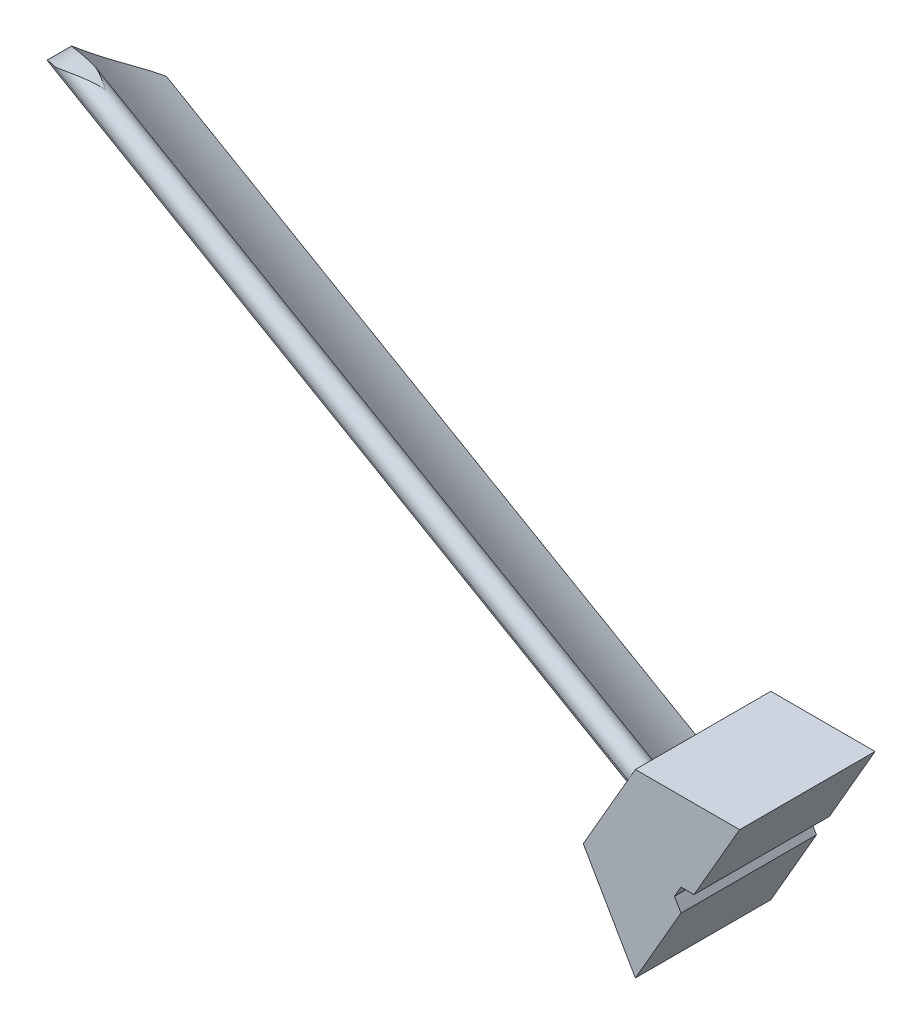
ISO-10303-21;
HEADER;
FILE_DESCRIPTION(('STEP AP214'),'2;1');
FILE_NAME('part.step','',(''),(''),'','','');
FILE_SCHEMA(('AUTOMOTIVE_DESIGN { 1 0 10303 214 1 1 1 1 }'));
ENDSEC;
DATA;
#1=APPLICATION_CONTEXT('core data for automotive mechanical design processes');
#2=APPLICATION_PROTOCOL_DEFINITION('international standard','automotive_design',2000,#1);
#3=PRODUCT_CONTEXT('',#1,'mechanical');
#4=PRODUCT('Part','Part','',(#3));
#5=PRODUCT_RELATED_PRODUCT_CATEGORY('part','',(#4));
#6=PRODUCT_DEFINITION_FORMATION('','',#4);
#7=PRODUCT_DEFINITION_CONTEXT('part definition',#1,'design');
#8=PRODUCT_DEFINITION('design','',#6,#7);
#9=PRODUCT_DEFINITION_SHAPE('','',#8);
#10=(LENGTH_UNIT() NAMED_UNIT(*) SI_UNIT(.MILLI.,.METRE.));
#11=(NAMED_UNIT(*) PLANE_ANGLE_UNIT() SI_UNIT($,.RADIAN.));
#12=(NAMED_UNIT(*) SI_UNIT($,.STERADIAN.) SOLID_ANGLE_UNIT());
#13=UNCERTAINTY_MEASURE_WITH_UNIT(LENGTH_MEASURE(1.E-05),#10,'distance_accuracy_value','');
#14=(GEOMETRIC_REPRESENTATION_CONTEXT(3) GLOBAL_UNCERTAINTY_ASSIGNED_CONTEXT((#13)) GLOBAL_UNIT_ASSIGNED_CONTEXT((#10,
#11,#12)) REPRESENTATION_CONTEXT('',''));
#15=CARTESIAN_POINT('',(0.,0.,0.));
#16=DIRECTION('',(0.,0.,1.));
#17=DIRECTION('',(1.,0.,0.));
#18=AXIS2_PLACEMENT_3D('',#15,#16,#17);
#19=CARTESIAN_POINT('',(-9.23760430703402,16.,24.));
#20=DIRECTION('',(0.866025403784439,-0.5,0.));
#21=DIRECTION('',(0.5,0.866025403784439,0.));
#22=AXIS2_PLACEMENT_3D('',#19,#20,#21);
#23=PLANE('',#22);
#24=CARTESIAN_POINT('',(-4.02817982507704,25.0229878809427,-1.9959936670744));
#25=DIRECTION('',(-0.866025403784439,0.5,0.));
#26=DIRECTION('',(0.5,0.866025403784439,0.));
#27=AXIS2_PLACEMENT_3D('',#24,#25,#26);
#28=CIRCLE('',#27,28.9199879292272);
#29=CARTESIAN_POINT('',(-18.4512267717139,0.0415377694163993,0.0700578635219086));
#30=VERTEX_POINT('',#29);
#31=CARTESIAN_POINT('',(-10.9585334040135,13.0192633678079,23.3860176580814));
#32=VERTEX_POINT('',#31);
#33=EDGE_CURVE('E280',#30,#32,#28,.T.);
#34=ORIENTED_EDGE('',*,*,#33,.F.);
#35=CARTESIAN_POINT('',(-18.375208614068,0.173205080756883,0.2));
#36=DIRECTION('',(-0.866025403784439,0.5,0.));
#37=DIRECTION('',(-0.5,-0.866025403784439,0.));
#38=AXIS2_PLACEMENT_3D('',#35,#36,#37);
#39=CIRCLE('',#38,0.2);
#40=CARTESIAN_POINT('',(-18.375208614068,0.173205080756883,0.));
#41=VERTEX_POINT('',#40);
#42=EDGE_CURVE('E209',#41,#30,#39,.T.);
#43=ORIENTED_EDGE('',*,*,#42,.F.);
#44=DIRECTION('',(-0.5,-0.866025403784439,0.));
#45=VECTOR('',#44,1.);
#46=CARTESIAN_POINT('',(-9.23760430703402,16.,0.));
#47=LINE('',#46,#45);
#48=CARTESIAN_POINT('',(-18.475208614068,0.,0.));
#49=VERTEX_POINT('',#48);
#50=EDGE_CURVE('E199',#41,#49,#47,.T.);
#51=ORIENTED_EDGE('',*,*,#50,.T.);
#52=DIRECTION('',(0.,0.,-1.));
#53=VECTOR('',#52,1.);
#54=CARTESIAN_POINT('',(-18.475208614068,0.,24.));
#55=LINE('',#54,#53);
#56=CARTESIAN_POINT('',(-18.475208614068,0.,24.));
#57=VERTEX_POINT('',#56);
#58=EDGE_CURVE('E203',#57,#49,#55,.T.);
#59=ORIENTED_EDGE('',*,*,#58,.F.);
#60=DIRECTION('',(-0.5,-0.866025403784439,0.));
#61=VECTOR('',#60,1.);
#62=CARTESIAN_POINT('',(-9.23760430703402,16.,24.));
#63=LINE('',#62,#61);
#64=CARTESIAN_POINT('',(-10.237604307034,14.2679491924312,24.));
#65=VERTEX_POINT('',#64);
#66=EDGE_CURVE('E181',#65,#57,#63,.T.);
#67=ORIENTED_EDGE('',*,*,#66,.F.);
#68=CARTESIAN_POINT('',(-10.237604307034,14.2679491924312,22.0000000000001));
#69=DIRECTION('',(-0.866025403784439,0.5,0.));
#70=DIRECTION('',(-0.5,-0.866025403784439,0.));
#71=AXIS2_PLACEMENT_3D('',#68,#69,#70);
#72=CIRCLE('',#71,2.);
#73=EDGE_CURVE('E254',#32,#65,#72,.T.);
#74=ORIENTED_EDGE('',*,*,#73,.F.);
#75=EDGE_LOOP('',(#34,#43,#51,#59,#67,#74));
#76=FACE_BOUND('',#75,.T.);
#77=ADVANCED_FACE('F33',(#76),#23,.F.);
#78=CARTESIAN_POINT('',(-9.23760430703402,16.,22.0000000000001));
#79=VERTEX_POINT('',#78);
#80=EDGE_CURVE('E274',#65,#79,#72,.T.);
#81=ORIENTED_EDGE('',*,*,#80,.F.);
#82=CARTESIAN_POINT('',(-9.23760430703402,16.,24.));
#83=VERTEX_POINT('',#82);
#84=EDGE_CURVE('E184',#83,#65,#63,.T.);
#85=ORIENTED_EDGE('',*,*,#84,.F.);
#86=DIRECTION('',(0.,0.,-1.));
#87=VECTOR('',#86,1.);
#88=CARTESIAN_POINT('',(-9.23760430703402,16.,24.));
#89=LINE('',#88,#87);
#90=EDGE_CURVE('E165',#83,#79,#89,.T.);
#91=ORIENTED_EDGE('',*,*,#90,.T.);
#92=EDGE_LOOP('',(#81,#85,#91));
#93=FACE_BOUND('',#92,.T.);
#94=ADVANCED_FACE('F332',(#93),#23,.F.);
#95=CARTESIAN_POINT('',(-9.54017674296634,15.4759291679953,20.5666894364743));
#96=VERTEX_POINT('',#95);
#97=EDGE_CURVE('E164',#79,#96,#72,.T.);
#98=ORIENTED_EDGE('',*,*,#97,.F.);
#99=CARTESIAN_POINT('',(-9.23760430703402,16.,0.));
#100=VERTEX_POINT('',#99);
#101=EDGE_CURVE('E206',#79,#100,#89,.T.);
#102=ORIENTED_EDGE('',*,*,#101,.T.);
#103=EDGE_CURVE('E187',#100,#41,#47,.T.);
#104=ORIENTED_EDGE('',*,*,#103,.T.);
#105=CARTESIAN_POINT('',(-18.2991904564221,0.304872392097363,0.0700578635219069));
#106=VERTEX_POINT('',#105);
#107=EDGE_CURVE('E277',#106,#41,#39,.T.);
#108=ORIENTED_EDGE('',*,*,#107,.F.);
#109=CARTESIAN_POINT('',(-3.07077257050956,26.6812658893886,-8.22628528919811));
#110=DIRECTION('',(0.866025403784439,-0.5,0.));
#111=DIRECTION('',(0.5,0.866025403784439,0.));
#112=AXIS2_PLACEMENT_3D('',#109,#110,#111);
#113=CIRCLE('',#112,31.5665670439408);
#114=EDGE_CURVE('E273',#96,#106,#113,.T.);
#115=ORIENTED_EDGE('',*,*,#114,.F.);
#116=EDGE_LOOP('',(#98,#102,#104,#108,#115));
#117=FACE_BOUND('',#116,.T.);
#118=ADVANCED_FACE('F334',(#117),#23,.F.);
#119=CARTESIAN_POINT('',(0.,0.,24.));
#120=DIRECTION('',(0.,0.,1.));
#121=DIRECTION('',(1.,0.,0.));
#122=AXIS2_PLACEMENT_3D('',#119,#120,#121);
#123=PLANE('',#122);
#124=DIRECTION('',(-0.5,-0.866025403784439,0.));
#125=VECTOR('',#124,1.);
#126=CARTESIAN_POINT('',(9.23760430703401,16.,24.));
#127=LINE('',#126,#125);
#128=CARTESIAN_POINT('',(9.23760430703401,16.,24.));
#129=VERTEX_POINT('',#128);
#130=CARTESIAN_POINT('',(1.15470053837925,2.00000000000002,24.));
#131=VERTEX_POINT('',#130);
#132=EDGE_CURVE('E156',#129,#131,#127,.T.);
#133=ORIENTED_EDGE('',*,*,#132,.F.);
#134=DIRECTION('',(-1.,0.,0.));
#135=VECTOR('',#134,1.);
#136=CARTESIAN_POINT('',(9.23760430703401,16.,24.));
#137=LINE('',#136,#135);
#138=EDGE_CURVE('E171',#129,#83,#137,.T.);
#139=ORIENTED_EDGE('',*,*,#138,.T.);
#140=ORIENTED_EDGE('',*,*,#84,.T.);
#141=ORIENTED_EDGE('',*,*,#66,.T.);
#142=DIRECTION('',(0.5,-0.866025403784438,0.));
#143=VECTOR('',#142,1.);
#144=CARTESIAN_POINT('',(-18.475208614068,0.,24.));
#145=LINE('',#144,#143);
#146=CARTESIAN_POINT('',(-9.23760430703401,-16.,24.));
#147=VERTEX_POINT('',#146);
#148=EDGE_CURVE('E193',#57,#147,#145,.T.);
#149=ORIENTED_EDGE('',*,*,#148,.T.);
#150=CARTESIAN_POINT('',(-1.15470053837926,-2.00000000000002,24.));
#151=VERTEX_POINT('',#150);
#152=EDGE_CURVE('E176',#151,#147,#127,.T.);
#153=ORIENTED_EDGE('',*,*,#152,.F.);
#154=DIRECTION('',(0.500000000000006,-0.866025403784435,0.));
#155=VECTOR('',#154,1.);
#156=CARTESIAN_POINT('',(-2.30940107675853,0.,24.));
#157=LINE('',#156,#155);
#158=CARTESIAN_POINT('',(-2.30940107675853,0.,24.));
#159=VERTEX_POINT('',#158);
#160=EDGE_CURVE('E294',#159,#151,#157,.T.);
#161=ORIENTED_EDGE('',*,*,#160,.F.);
#162=DIRECTION('',(-0.500000000000001,-0.866025403784438,0.));
#163=VECTOR('',#162,1.);
#164=CARTESIAN_POINT('',(-1.15470053837926,2.00000000000002,24.));
#165=LINE('',#164,#163);
#166=CARTESIAN_POINT('',(-1.15470053837926,2.00000000000002,24.));
#167=VERTEX_POINT('',#166);
#168=EDGE_CURVE('E291',#167,#159,#165,.T.);
#169=ORIENTED_EDGE('',*,*,#168,.F.);
#170=DIRECTION('',(-1.,0.,0.));
#171=VECTOR('',#170,1.);
#172=CARTESIAN_POINT('',(1.15470053837925,2.00000000000002,24.));
#173=LINE('',#172,#171);
#174=EDGE_CURVE('E174',#131,#167,#173,.T.);
#175=ORIENTED_EDGE('',*,*,#174,.F.);
#176=EDGE_LOOP('',(#133,#139,#140,#141,#149,#153,#161,#169,#175));
#177=FACE_BOUND('',#176,.T.);
#178=ADVANCED_FACE('F169',(#177),#123,.T.);
#179=CARTESIAN_POINT('',(0.,0.,0.));
#180=DIRECTION('',(0.,0.,1.));
#181=DIRECTION('',(1.,0.,0.));
#182=AXIS2_PLACEMENT_3D('',#179,#180,#181);
#183=PLANE('',#182);
#184=DIRECTION('',(-1.,0.,0.));
#185=VECTOR('',#184,1.);
#186=CARTESIAN_POINT('',(9.23760430703401,16.,0.));
#187=LINE('',#186,#185);
#188=CARTESIAN_POINT('',(9.23760430703401,16.,0.));
#189=VERTEX_POINT('',#188);
#190=EDGE_CURVE('E197',#189,#100,#187,.T.);
#191=ORIENTED_EDGE('',*,*,#190,.F.);
#192=DIRECTION('',(-0.5,-0.866025403784439,0.));
#193=VECTOR('',#192,1.);
#194=CARTESIAN_POINT('',(0.,0.,0.));
#195=LINE('',#194,#193);
#196=CARTESIAN_POINT('',(1.15470053837926,2.00000000000002,0.));
#197=VERTEX_POINT('',#196);
#198=EDGE_CURVE('E159',#189,#197,#195,.T.);
#199=ORIENTED_EDGE('',*,*,#198,.T.);
#200=DIRECTION('',(-1.,0.,0.));
#201=VECTOR('',#200,1.);
#202=CARTESIAN_POINT('',(1.15470053837925,2.00000000000002,0.));
#203=LINE('',#202,#201);
#204=CARTESIAN_POINT('',(-1.15470053837926,2.00000000000002,0.));
#205=VERTEX_POINT('',#204);
#206=EDGE_CURVE('E289',#197,#205,#203,.T.);
#207=ORIENTED_EDGE('',*,*,#206,.T.);
#208=DIRECTION('',(-0.500000000000001,-0.866025403784438,0.));
#209=VECTOR('',#208,1.);
#210=CARTESIAN_POINT('',(-1.15470053837926,2.00000000000002,0.));
#211=LINE('',#210,#209);
#212=CARTESIAN_POINT('',(-2.30940107675853,0.,0.));
#213=VERTEX_POINT('',#212);
#214=EDGE_CURVE('E300',#205,#213,#211,.T.);
#215=ORIENTED_EDGE('',*,*,#214,.T.);
#216=DIRECTION('',(0.500000000000006,-0.866025403784435,0.));
#217=VECTOR('',#216,1.);
#218=CARTESIAN_POINT('',(-2.30940107675853,0.,0.));
#219=LINE('',#218,#217);
#220=CARTESIAN_POINT('',(-1.15470053837926,-2.00000000000002,0.));
#221=VERTEX_POINT('',#220);
#222=EDGE_CURVE('E292',#213,#221,#219,.T.);
#223=ORIENTED_EDGE('',*,*,#222,.T.);
#224=CARTESIAN_POINT('',(-9.23760430703401,-16.,0.));
#225=VERTEX_POINT('',#224);
#226=EDGE_CURVE('E175',#221,#225,#195,.T.);
#227=ORIENTED_EDGE('',*,*,#226,.T.);
#228=DIRECTION('',(0.5,-0.866025403784438,0.));
#229=VECTOR('',#228,1.);
#230=CARTESIAN_POINT('',(-18.475208614068,0.,0.));
#231=LINE('',#230,#229);
#232=EDGE_CURVE('E182',#49,#225,#231,.T.);
#233=ORIENTED_EDGE('',*,*,#232,.F.);
#234=ORIENTED_EDGE('',*,*,#50,.F.);
#235=ORIENTED_EDGE('',*,*,#103,.F.);
#236=EDGE_LOOP('',(#191,#199,#207,#215,#223,#227,#233,#234,#235));
#237=FACE_BOUND('',#236,.T.);
#238=ADVANCED_FACE('F314',(#237),#183,.F.);
#239=CARTESIAN_POINT('',(9.23760430703401,16.,24.));
#240=DIRECTION('',(0.,-1.,0.));
#241=DIRECTION('',(0.,0.,-1.));
#242=AXIS2_PLACEMENT_3D('',#239,#240,#241);
#243=PLANE('',#242);
#244=ORIENTED_EDGE('',*,*,#190,.T.);
#245=ORIENTED_EDGE('',*,*,#101,.F.);
#246=ORIENTED_EDGE('',*,*,#90,.F.);
#247=ORIENTED_EDGE('',*,*,#138,.F.);
#248=DIRECTION('',(0.,0.,-1.));
#249=VECTOR('',#248,1.);
#250=CARTESIAN_POINT('',(9.23760430703401,16.,24.));
#251=LINE('',#250,#249);
#252=EDGE_CURVE('E153',#129,#189,#251,.T.);
#253=ORIENTED_EDGE('',*,*,#252,.T.);
#254=EDGE_LOOP('',(#244,#245,#246,#247,#253));
#255=FACE_BOUND('',#254,.T.);
#256=ADVANCED_FACE('F35',(#255),#243,.F.);
#257=CARTESIAN_POINT('',(-18.475208614068,0.,24.));
#258=DIRECTION('',(0.866025403784439,0.5,0.));
#259=DIRECTION('',(-0.5,0.866025403784439,0.));
#260=AXIS2_PLACEMENT_3D('',#257,#258,#259);
#261=PLANE('',#260);
#262=ORIENTED_EDGE('',*,*,#232,.T.);
#263=DIRECTION('',(0.,0.,-1.));
#264=VECTOR('',#263,1.);
#265=CARTESIAN_POINT('',(-9.23760430703401,-16.,24.));
#266=LINE('',#265,#264);
#267=EDGE_CURVE('E196',#147,#225,#266,.T.);
#268=ORIENTED_EDGE('',*,*,#267,.F.);
#269=ORIENTED_EDGE('',*,*,#148,.F.);
#270=ORIENTED_EDGE('',*,*,#58,.T.);
#271=EDGE_LOOP('',(#262,#268,#269,#270));
#272=FACE_BOUND('',#271,.T.);
#273=ADVANCED_FACE('F321',(#272),#261,.F.);
#274=CARTESIAN_POINT('',(1.15470053837925,2.00000000000002,24.));
#275=DIRECTION('',(0.,-1.,0.));
#276=DIRECTION('',(0.,0.,-1.));
#277=AXIS2_PLACEMENT_3D('',#274,#275,#276);
#278=PLANE('',#277);
#279=ORIENTED_EDGE('',*,*,#206,.F.);
#280=DIRECTION('',(0.,0.,-1.));
#281=VECTOR('',#280,1.);
#282=CARTESIAN_POINT('',(1.15470053837925,2.00000000000002,24.));
#283=LINE('',#282,#281);
#284=EDGE_CURVE('E190',#131,#197,#283,.T.);
#285=ORIENTED_EDGE('',*,*,#284,.F.);
#286=ORIENTED_EDGE('',*,*,#174,.T.);
#287=DIRECTION('',(0.,0.,-1.));
#288=VECTOR('',#287,1.);
#289=CARTESIAN_POINT('',(-1.15470053837926,2.00000000000002,24.));
#290=LINE('',#289,#288);
#291=EDGE_CURVE('E308',#167,#205,#290,.T.);
#292=ORIENTED_EDGE('',*,*,#291,.T.);
#293=EDGE_LOOP('',(#279,#285,#286,#292));
#294=FACE_BOUND('',#293,.T.);
#295=ADVANCED_FACE('F318',(#294),#278,.T.);
#296=CARTESIAN_POINT('',(-1.15470053837926,2.00000000000002,24.));
#297=DIRECTION('',(0.866025403784438,-0.500000000000001,0.));
#298=DIRECTION('',(0.500000000000001,0.866025403784438,0.));
#299=AXIS2_PLACEMENT_3D('',#296,#297,#298);
#300=PLANE('',#299);
#301=ORIENTED_EDGE('',*,*,#214,.F.);
#302=ORIENTED_EDGE('',*,*,#291,.F.);
#303=ORIENTED_EDGE('',*,*,#168,.T.);
#304=DIRECTION('',(0.,0.,-1.));
#305=VECTOR('',#304,1.);
#306=CARTESIAN_POINT('',(-2.30940107675853,0.,24.));
#307=LINE('',#306,#305);
#308=EDGE_CURVE('E307',#159,#213,#307,.T.);
#309=ORIENTED_EDGE('',*,*,#308,.T.);
#310=EDGE_LOOP('',(#301,#302,#303,#309));
#311=FACE_BOUND('',#310,.T.);
#312=ADVANCED_FACE('F320',(#311),#300,.T.);
#313=CARTESIAN_POINT('',(-2.30940107675853,0.,24.));
#314=DIRECTION('',(0.866025403784435,0.500000000000006,0.));
#315=DIRECTION('',(-0.500000000000006,0.866025403784435,0.));
#316=AXIS2_PLACEMENT_3D('',#313,#314,#315);
#317=PLANE('',#316);
#318=ORIENTED_EDGE('',*,*,#222,.F.);
#319=ORIENTED_EDGE('',*,*,#308,.F.);
#320=ORIENTED_EDGE('',*,*,#160,.T.);
#321=DIRECTION('',(0.,0.,-1.));
#322=VECTOR('',#321,1.);
#323=CARTESIAN_POINT('',(-1.15470053837926,-2.00000000000002,24.));
#324=LINE('',#323,#322);
#325=EDGE_CURVE('E297',#151,#221,#324,.T.);
#326=ORIENTED_EDGE('',*,*,#325,.T.);
#327=EDGE_LOOP('',(#318,#319,#320,#326));
#328=FACE_BOUND('',#327,.T.);
#329=ADVANCED_FACE('F231',(#328),#317,.T.);
#330=CARTESIAN_POINT('',(-114.160652761167,74.2679491924312,22.0000000000001));
#331=DIRECTION('',(0.866025403784439,-0.5,0.));
#332=DIRECTION('',(0.5,0.866025403784439,0.));
#333=AXIS2_PLACEMENT_3D('',#330,#331,#332);
#334=CYLINDRICAL_SURFACE('',#333,2.);
#335=DIRECTION('',(0.866025403784439,-0.5,0.));
#336=VECTOR('',#335,1.);
#337=CARTESIAN_POINT('',(-113.463225197099,75.4759291679953,20.5666894364743));
#338=LINE('',#337,#336);
#339=CARTESIAN_POINT('',(-108.328060596806,72.5111405036834,20.5666894364742));
#340=VERTEX_POINT('',#339);
#341=EDGE_CURVE('E287',#340,#96,#338,.T.);
#342=ORIENTED_EDGE('',*,*,#341,.F.);
#343=CARTESIAN_POINT('',(-108.328060596806,72.5111405036834,20.5666894364742));
#344=CARTESIAN_POINT('',(-108.185750200659,72.4882949807864,20.6167004446375));
#345=CARTESIAN_POINT('',(-108.044692144843,72.4622321820191,20.6687304028651));
#346=CARTESIAN_POINT('',(-107.765212976878,72.4038752900972,20.7761619795796));
#347=CARTESIAN_POINT('',(-107.626791184924,72.371582827939,20.8315627129659));
#348=CARTESIAN_POINT('',(-107.352676109039,72.3009664272526,20.9450824289283));
#349=CARTESIAN_POINT('',(-107.216982160389,72.262643978702,21.0032007375192));
#350=CARTESIAN_POINT('',(-106.948362076143,72.1801264087187,21.1216189511067));
#351=CARTESIAN_POINT('',(-106.815436108368,72.1359309323998,21.1819189877772));
#352=CARTESIAN_POINT('',(-106.424624017879,71.9960810167973,21.3636060918149));
#353=CARTESIAN_POINT('',(-106.170790747821,71.8921450037323,21.487429615361));
#354=CARTESIAN_POINT('',(-105.674768620484,71.6628872716582,21.7381415162455));
#355=CARTESIAN_POINT('',(-105.432572880823,71.5375783970454,21.8650280137467));
#356=CARTESIAN_POINT('',(-105.19147112489,71.3989845076477,21.9945950188014));
#357=CARTESIAN_POINT('',(-105.186444994281,71.3960889945059,21.9972975220793));
#358=CARTESIAN_POINT('',(-105.181421645875,71.3931887676601,22.0000000000001));
#359=B_SPLINE_CURVE_WITH_KNOTS('',3,(#343,#344,#345,#346,#347,#348,#349,#350,#351,#352,#353,
#354,#355,#356,#357,#358),.UNSPECIFIED.,.F.,.F.,(4,2,2,2,2,2,2,4),(0.,0.457598475343755,
0.915077308411905,1.37244327789457,1.82983689695642,2.73156949959285,3.63276208739183,
3.65195961766604),.UNSPECIFIED.);
#360=CARTESIAN_POINT('',(-105.181421645875,71.3931887676601,22.0000000000001));
#361=VERTEX_POINT('',#360);
#362=EDGE_CURVE('E239',#340,#361,#359,.T.);
#363=ORIENTED_EDGE('',*,*,#362,.T.);
#364=CARTESIAN_POINT('',(-105.114365337323,71.3540962614766,21.9638380059937));
#365=CARTESIAN_POINT('',(-105.131663942905,71.3642788761109,21.9731891957275));
#366=CARTESIAN_POINT('',(-105.148995394022,71.3744047118362,21.9825406955754));
#367=CARTESIAN_POINT('',(-105.171377599523,71.3873835098483,21.9945949777944));
#368=CARTESIAN_POINT('',(-105.176398251257,71.3902885095174,21.9972974759486));
#369=CARTESIAN_POINT('',(-105.181421645875,71.3931887676601,22.0000000000001));
#370=B_SPLINE_CURVE_WITH_KNOTS('',3,(#364,#365,#366,#367,#368,#369),.UNSPECIFIED.,.F.,.F.,(4,2,
4),(0.,0.0664323766493922,0.0856299069235968),.UNSPECIFIED.);
#371=CARTESIAN_POINT('',(-105.114365337323,71.3540962614766,21.9638380059935));
#372=VERTEX_POINT('',#371);
#373=EDGE_CURVE('E255',#361,#372,#370,.F.);
#374=ORIENTED_EDGE('',*,*,#373,.T.);
#375=CARTESIAN_POINT('',(-106.114201862735,69.6223286002004,22.0000000000001));
#376=DIRECTION('',(0.866025403784439,-0.5,0.));
#377=DIRECTION('',(0.499918262705857,0.865883830638108,-0.0180809970033081));
#378=AXIS2_PLACEMENT_3D('',#375,#376,#377);
#379=CIRCLE('',#378,2.00000000000001);
#380=CARTESIAN_POINT('',(-105.114365337323,71.3540962614766,22.0361619940066));
#381=VERTEX_POINT('',#380);
#382=EDGE_CURVE('E11',#372,#381,#379,.T.);
#383=ORIENTED_EDGE('',*,*,#382,.T.);
#384=CARTESIAN_POINT('',(-105.114365337323,71.3540962614766,22.0361619940065));
#385=CARTESIAN_POINT('',(-105.131663942905,71.3642788761109,22.0268108042729));
#386=CARTESIAN_POINT('',(-105.148995394022,71.3744047118362,22.017459304425));
#387=CARTESIAN_POINT('',(-105.171377599523,71.3873835098483,22.0054050222058));
#388=CARTESIAN_POINT('',(-105.176398251257,71.3902885095175,22.0027025240515));
#389=CARTESIAN_POINT('',(-105.181421645875,71.3931887676601,22.0000000000001));
#390=B_SPLINE_CURVE_WITH_KNOTS('',3,(#384,#385,#386,#387,#388,#389),.UNSPECIFIED.,.F.,.F.,(4,2,
4),(0.,0.0664323766494272,0.0856299069236231),.UNSPECIFIED.);
#391=EDGE_CURVE('E252',#381,#361,#390,.T.);
#392=ORIENTED_EDGE('',*,*,#391,.T.);
#393=CARTESIAN_POINT('',(-113.121931282864,72.0033286344889,23.3860176580814));
#394=CARTESIAN_POINT('',(-113.069873413456,72.0235423176739,23.4313113297646));
#395=CARTESIAN_POINT('',(-113.015555743239,72.0440710331597,23.4737845756024));
#396=CARTESIAN_POINT('',(-112.903169722411,72.0852632199291,23.5531386600222));
#397=CARTESIAN_POINT('',(-112.845108000312,72.1059263978319,23.5900290149174));
#398=CARTESIAN_POINT('',(-112.726448950097,72.1467482300241,23.6580597567401));
#399=CARTESIAN_POINT('',(-112.665884901944,72.1669099083865,23.6892567882534));
#400=CARTESIAN_POINT('',(-112.542194701369,72.2066111473305,23.7466185136256));
#401=CARTESIAN_POINT('',(-112.479067158394,72.2261503597217,23.7727804308375));
#402=CARTESIAN_POINT('',(-112.330799522109,72.2702481119349,23.8277283455301));
#403=CARTESIAN_POINT('',(-112.244922487377,72.2944764863497,23.85479749239));
#404=CARTESIAN_POINT('',(-112.070588317804,72.3408756851385,23.901419944647));
#405=CARTESIAN_POINT('',(-111.982129279595,72.3630449385393,23.9209675467582));
#406=CARTESIAN_POINT('',(-111.713310017072,72.426101214621,23.9695269576185));
#407=CARTESIAN_POINT('',(-111.530163270256,72.4633394362974,23.9882275257593));
#408=CARTESIAN_POINT('',(-111.207239079791,72.5187461113742,24.0016641166158));
#409=CARTESIAN_POINT('',(-111.067985984735,72.5393537614493,24.0011980299659));
#410=CARTESIAN_POINT('',(-110.789036113971,72.5741410644579,23.9897968551192));
#411=CARTESIAN_POINT('',(-110.649339155792,72.5883175941234,23.9788566881993));
#412=CARTESIAN_POINT('',(-110.370376972542,72.6102368966745,23.9481693018106));
#413=CARTESIAN_POINT('',(-110.231112011512,72.6179763004458,23.928417478725));
#414=CARTESIAN_POINT('',(-109.953608735515,72.6271424173535,23.8815060166894));
#415=CARTESIAN_POINT('',(-109.815370772107,72.6285670600178,23.8543439511811));
#416=CARTESIAN_POINT('',(-109.460995334771,72.6243198814153,23.7763282908241));
#417=CARTESIAN_POINT('',(-109.245920263868,72.6140804886391,23.7208465037199));
#418=CARTESIAN_POINT('',(-108.820340023899,72.5790910132186,23.5980893972844));
#419=CARTESIAN_POINT('',(-108.609837640783,72.5543323282301,23.5308071030039));
#420=CARTESIAN_POINT('',(-108.193788242063,72.4910118505338,23.3871854362891));
#421=CARTESIAN_POINT('',(-107.988247887808,72.4524324964639,23.3108346237434));
#422=CARTESIAN_POINT('',(-107.582848069673,72.3621547756793,23.151412128832));
#423=CARTESIAN_POINT('',(-107.382987228326,72.3104596206967,23.0683420952232));
#424=CARTESIAN_POINT('',(-106.834804310973,72.1490718775124,22.8303005115056));
#425=CARTESIAN_POINT('',(-106.492785887602,72.0256633069376,22.6699651684252));
#426=CARTESIAN_POINT('',(-105.829145693911,71.7414104856001,22.3424225487604));
#427=CARTESIAN_POINT('',(-105.507484934794,71.5806407303185,22.175229485217));
#428=CARTESIAN_POINT('',(-105.191471111698,71.3989844966277,22.0054049725934));
#429=CARTESIAN_POINT('',(-105.186444981133,71.3960889834087,22.0027024692763));
#430=CARTESIAN_POINT('',(-105.181421645875,71.3931887676601,22.0000000000001));
#431=B_SPLINE_CURVE_WITH_KNOTS('',3,(#393,#394,#395,#396,#397,#398,#399,#400,#401,#402,#403,
#404,#405,#406,#407,#408,#409,#410,#411,#412,#413,#414,#415,#416,#417,#418,#419,#420,#421,#422,
#423,#424,#425,#426,#427,#428,#429,#430),.UNSPECIFIED.,.F.,.F.,(4,2,2,2,2,2,2,2,2,2,2,2,2,2,2,2,
2,2,4),(0.,0.215544849098195,0.430718049753589,0.643617346081985,0.856633712819301,
1.1359376852093,1.41545302720545,1.97662222796936,2.39843636685681,2.82045514068012,
3.24269465530366,3.66507260279966,4.33109530685634,4.99751301317995,5.66478053051821,
6.33188480814394,7.52139788586062,8.70855920853911,8.72775673881446),.UNSPECIFIED.);
#432=CARTESIAN_POINT('',(-113.121931282864,72.0033286344889,23.3860176580814));
#433=VERTEX_POINT('',#432);
#434=EDGE_CURVE('E247',#361,#433,#431,.F.);
#435=ORIENTED_EDGE('',*,*,#434,.T.);
#436=DIRECTION('',(0.866025403784439,-0.5,0.));
#437=VECTOR('',#436,1.);
#438=CARTESIAN_POINT('',(-114.881581858146,73.0192633678079,23.3860176580814));
#439=LINE('',#438,#437);
#440=EDGE_CURVE('E282',#433,#32,#439,.T.);
#441=ORIENTED_EDGE('',*,*,#440,.T.);
#442=ORIENTED_EDGE('',*,*,#73,.T.);
#443=ORIENTED_EDGE('',*,*,#80,.T.);
#444=ORIENTED_EDGE('',*,*,#97,.T.);
#445=EDGE_LOOP('',(#342,#363,#374,#383,#392,#435,#441,#442,#443,#444));
#446=FACE_BOUND('',#445,.T.);
#447=ADVANCED_FACE('F225',(#446),#334,.T.);
#448=CARTESIAN_POINT('',(-106.993821024642,86.6812658893886,-8.22628528919811));
#449=DIRECTION('',(0.866025403784439,-0.5,0.));
#450=DIRECTION('',(0.5,0.866025403784439,0.));
#451=AXIS2_PLACEMENT_3D('',#448,#449,#450);
#452=CYLINDRICAL_SURFACE('',#451,31.5665670439408);
#453=DIRECTION('',(0.866025403784439,-0.5,0.));
#454=VECTOR('',#453,1.);
#455=CARTESIAN_POINT('',(-122.222238910555,60.3048723920974,0.0700578635219069));
#456=LINE('',#455,#454);
#457=CARTESIAN_POINT('',(-116.276003246944,56.8718116310468,0.0700578635219022));
#458=VERTEX_POINT('',#457);
#459=EDGE_CURVE('E285',#458,#106,#456,.T.);
#460=ORIENTED_EDGE('',*,*,#459,.F.);
#461=CARTESIAN_POINT('',(-116.276003246944,56.8718116310468,0.0700578635219051));
#462=CARTESIAN_POINT('',(-116.326712116874,56.9221044792505,0.136878222757053));
#463=CARTESIAN_POINT('',(-116.376109308208,56.9722547915729,0.20477691162493));
#464=CARTESIAN_POINT('',(-116.47250716966,57.0723365745316,0.342382736363965));
#465=CARTESIAN_POINT('',(-116.51950839663,57.1222680935297,0.41208944629452));
#466=CARTESIAN_POINT('',(-116.657207018034,57.2717757835039,0.623315710200128));
#467=CARTESIAN_POINT('',(-116.744693077084,57.3711586373208,0.767067320067653));
#468=CARTESIAN_POINT('',(-116.91223008348,57.5696176023528,1.05833975690119));
#469=CARTESIAN_POINT('',(-116.992299439586,57.6686938490056,1.20585002595472));
#470=CARTESIAN_POINT('',(-117.146220640004,57.8671919851563,1.50390314844901));
#471=CARTESIAN_POINT('',(-117.220070770503,57.9666139621176,1.65444682372502));
#472=CARTESIAN_POINT('',(-117.433627789546,58.2662235247586,2.10996317189704));
#473=CARTESIAN_POINT('',(-117.565010755835,58.4673584461785,2.41822854803341));
#474=CARTESIAN_POINT('',(-117.80909712607,58.8738367324309,3.03972625727374));
#475=CARTESIAN_POINT('',(-117.921781869597,59.0791840743115,3.35296321447686));
#476=CARTESIAN_POINT('',(-118.12377608841,59.482380582435,3.96310796071496));
#477=CARTESIAN_POINT('',(-118.214079015512,59.6799462556891,4.25987511528762));
#478=CARTESIAN_POINT('',(-118.380169475987,60.0798415398219,4.85429863229291));
#479=CARTESIAN_POINT('',(-118.455955574831,60.2821716192951,5.15195507965532));
#480=CARTESIAN_POINT('',(-118.593198934838,60.691813088615,5.74721803588973));
#481=CARTESIAN_POINT('',(-118.654653877519,60.8991252784873,6.0448245289087));
#482=CARTESIAN_POINT('',(-118.76307912665,61.3187424466212,6.63915743846994));
#483=CARTESIAN_POINT('',(-118.810049506459,61.5310473995903,6.93588385946198));
#484=CARTESIAN_POINT('',(-118.889163515345,61.9607942713221,7.52809268431011));
#485=CARTESIAN_POINT('',(-118.921291062965,62.1782414946937,7.82357339678577));
#486=CARTESIAN_POINT('',(-118.970060090858,62.6178449374766,8.41233174879462));
#487=CARTESIAN_POINT('',(-118.986700924707,62.8400013530568,8.70560929585949));
#488=CARTESIAN_POINT('',(-119.003733266271,63.2885412341357,9.28913593660284));
#489=CARTESIAN_POINT('',(-119.004134305211,63.5149221421939,9.57938670669819));
#490=CARTESIAN_POINT('',(-118.987805257823,63.9715371368546,10.1563491600698));
#491=CARTESIAN_POINT('',(-118.971075560264,64.2017711358977,10.4430609235115));
#492=CARTESIAN_POINT('',(-118.913103944311,64.7223927645681,11.0821290866471));
#493=CARTESIAN_POINT('',(-118.86685325835,65.0136740547942,11.4333241870617));
#494=CARTESIAN_POINT('',(-118.743884417335,65.5995275049101,12.1275610363649));
#495=CARTESIAN_POINT('',(-118.66716847742,65.8940994240242,12.470603376122));
#496=CARTESIAN_POINT('',(-118.480963218158,66.4835827514729,13.1460016960157));
#497=CARTESIAN_POINT('',(-118.371550531083,66.7784917771453,13.4783806729218));
#498=CARTESIAN_POINT('',(-118.11725107126,67.3662706599508,14.1311863038706));
#499=CARTESIAN_POINT('',(-117.972372705733,67.6591409834661,14.4516157698583));
#500=CARTESIAN_POINT('',(-117.681443165393,68.1736498491972,15.0076704130283));
#501=CARTESIAN_POINT('',(-117.542984546876,68.3964942669216,15.2461599958873));
#502=CARTESIAN_POINT('',(-117.242100414918,68.8362880506357,15.7133257211746));
#503=CARTESIAN_POINT('',(-117.079676078613,69.0532377055418,15.9420023448787));
#504=CARTESIAN_POINT('',(-116.730081579739,69.4783845908127,16.3880684334158));
#505=CARTESIAN_POINT('',(-116.542924940721,69.6865865229932,16.6054639768814));
#506=CARTESIAN_POINT('',(-116.143286671748,70.091151919637,17.027657276108));
#507=CARTESIAN_POINT('',(-115.930810042303,70.2875177101534,17.2324575072772));
#508=CARTESIAN_POINT('',(-115.523062132238,70.6291746584619,17.5906756244087));
#509=CARTESIAN_POINT('',(-115.332111201128,70.7771110294965,17.7464964033689));
#510=CARTESIAN_POINT('',(-114.933906807711,71.0606952922731,18.0481395614685));
#511=CARTESIAN_POINT('',(-114.726656635992,71.1963456525513,18.1939639476704));
#512=CARTESIAN_POINT('',(-114.296528057149,71.4531642942897,18.4749227411208));
#513=CARTESIAN_POINT('',(-114.073651166259,71.5743339777091,18.6100581827997));
#514=CARTESIAN_POINT('',(-113.613324913895,71.7999699957684,18.8690396050971));
#515=CARTESIAN_POINT('',(-113.375875659495,71.9044364531186,18.9928856686505));
#516=CARTESIAN_POINT('',(-112.886178221132,72.0951494270808,19.229617262141));
#517=CARTESIAN_POINT('',(-112.633837938714,72.1812630433807,19.3424198438807));
#518=CARTESIAN_POINT('',(-112.117794549627,72.3322680262505,19.5557180520957));
#519=CARTESIAN_POINT('',(-111.85409005936,72.3971568003744,19.6562121742532));
#520=CARTESIAN_POINT('',(-111.317999425534,72.5038004682647,19.8445533554322));
#521=CARTESIAN_POINT('',(-111.04562447243,72.5455839968205,19.9324159684934));
#522=CARTESIAN_POINT('',(-110.494664379465,72.6046334163018,20.0955440421891));
#523=CARTESIAN_POINT('',(-110.216082519588,72.6219119585339,20.1708159853502));
#524=CARTESIAN_POINT('',(-109.669050249985,72.6306680492851,20.3055377414719));
#525=CARTESIAN_POINT('',(-109.400767109427,72.6233610714995,20.3655795509714));
#526=CARTESIAN_POINT('',(-108.998155906515,72.5946288329774,20.4472450883549));
#527=CARTESIAN_POINT('',(-108.863981575904,72.5820990984218,20.4730576644535));
#528=CARTESIAN_POINT('',(-108.595812570799,72.5510902272943,20.5219303482297));
#529=CARTESIAN_POINT('',(-108.4618179054,72.5326108001463,20.5449903213981));
#530=CARTESIAN_POINT('',(-108.328060596806,72.5111405036834,20.5666894364742));
#531=B_SPLINE_CURVE_WITH_KNOTS('',3,(#461,#462,#463,#464,#465,#466,#467,#468,#469,#470,#471,
#472,#473,#474,#475,#476,#477,#478,#479,#480,#481,#482,#483,#484,#485,#486,#487,#488,#489,#490,
#491,#492,#493,#494,#495,#496,#497,#498,#499,#500,#501,#502,#503,#504,#505,#506,#507,#508,#509,
#510,#511,#512,#513,#514,#515,#516,#517,#518,#519,#520,#521,#522,#523,#524,#525,#526,#527,#528,
#529,#530),.UNSPECIFIED.,.F.,.F.,(4,2,2,2,2,2,2,2,2,2,2,2,2,2,2,2,2,2,2,2,2,2,2,2,2,2,2,2,2,2,2,
2,2,2,4),(0.,0.293372981791114,0.586677466373486,1.17273903433299,1.75730462713508,
2.34203078336169,3.51383614538555,4.68680400039732,5.78979685992663,6.89289865919798,
7.99617879367411,9.0994533402936,10.2039204418473,11.3084336424962,12.4122985889146,
13.5161384845626,14.8909250485246,16.265611669563,17.6371013364873,19.0082662029218,
20.0710386816347,21.133758977028,22.1959005660711,23.2578327365783,24.1193581277753,
24.9807100333309,25.8419784786793,26.703240596415,27.570542132012,28.4379495620895,
29.3042795737773,30.1701621581057,30.9938782478341,31.4053657199233,31.8168732916351),.UNSPECIFIED.);
#532=EDGE_CURVE('E362',#458,#340,#531,.T.);
#533=ORIENTED_EDGE('',*,*,#532,.T.);
#534=ORIENTED_EDGE('',*,*,#341,.T.);
#535=ORIENTED_EDGE('',*,*,#114,.T.);
#536=EDGE_LOOP('',(#460,#533,#534,#535));
#537=FACE_BOUND('',#536,.T.);
#538=ADVANCED_FACE('F230',(#537),#452,.F.);
#539=CARTESIAN_POINT('',(-122.298257068201,60.1732050807569,0.2));
#540=DIRECTION('',(0.866025403784439,-0.5,0.));
#541=DIRECTION('',(0.5,0.866025403784439,0.));
#542=AXIS2_PLACEMENT_3D('',#539,#540,#541);
#543=CYLINDRICAL_SURFACE('',#542,0.2);
#544=CARTESIAN_POINT('',(-114.313260632703,55.3880643847771,0.0694970279961415));
#545=CARTESIAN_POINT('',(-114.342286400483,55.4044291804604,0.069895694998094));
#546=CARTESIAN_POINT('',(-114.371225229642,55.4209525492653,0.0700810085465881));
#547=CARTESIAN_POINT('',(-114.428922062272,55.4543123606751,0.0700304338570176));
#548=CARTESIAN_POINT('',(-114.457680063168,55.4711488077225,0.0697945396377277));
#549=CARTESIAN_POINT('',(-114.543785213506,55.5221885553645,0.0684615298987146));
#550=CARTESIAN_POINT('',(-114.600847962319,55.5568571180997,0.0667375415720986));
#551=CARTESIAN_POINT('',(-114.771518408623,55.6631034244964,0.0595041212278806));
#552=CARTESIAN_POINT('',(-114.883892730833,55.7365184103503,0.0519293503206358));
#553=CARTESIAN_POINT('',(-115.105319197257,55.8881711552471,0.0354853478974511));
#554=CARTESIAN_POINT('',(-115.214368927922,55.9664122989496,0.026615201813273));
#555=CARTESIAN_POINT('',(-115.428501477962,56.1272556705173,0.0114309127096197));
#556=CARTESIAN_POINT('',(-115.53360286296,56.2098314580602,0.00510293878191991));
#557=CARTESIAN_POINT('',(-115.688540791537,56.3371171049691,0.000448365887432563));
#558=CARTESIAN_POINT('',(-115.739720544838,56.3801035439713,-0.000297391863118898));
#559=CARTESIAN_POINT('',(-115.841118178676,56.4671685224811,0.00052169202711844));
#560=CARTESIAN_POINT('',(-115.891336345665,56.5112467274912,0.00208583435906664));
#561=CARTESIAN_POINT('',(-115.96979304477,56.5816337831616,0.00721115775470761));
#562=CARTESIAN_POINT('',(-115.998393757169,56.6076200921745,0.00965590285834545));
#563=CARTESIAN_POINT('',(-116.055163556218,56.6598548816336,0.0159970442335539));
#564=CARTESIAN_POINT('',(-116.083332950757,56.6861031506351,0.0198923494317756));
#565=CARTESIAN_POINT('',(-116.125295272615,56.7256953590307,0.0272142915109137));
#566=CARTESIAN_POINT('',(-116.139278560297,56.7389724341817,0.0299125181595053));
#567=CARTESIAN_POINT('',(-116.167092122054,56.7655470472792,0.0359035358108134));
#568=CARTESIAN_POINT('',(-116.180922432539,56.7788445794595,0.039196181958739));
#569=CARTESIAN_POINT('',(-116.208436535135,56.8054638433783,0.0465101209536973));
#570=CARTESIAN_POINT('',(-116.222119904696,56.8187855582136,0.0505331141848644));
#571=CARTESIAN_POINT('',(-116.249254637947,56.8453657298894,0.0595280002222253));
#572=CARTESIAN_POINT('',(-116.262705798611,56.8586241247015,0.06450068166998));
#573=CARTESIAN_POINT('',(-116.276003246944,56.8718116310468,0.0700578635218999));
#574=B_SPLINE_CURVE_WITH_KNOTS('',3,(#544,#545,#546,#547,#548,#549,#550,#551,#552,#553,#554,
#555,#556,#557,#558,#559,#560,#561,#562,#563,#564,#565,#566,#567,#568,#569,#570,#571,#572,#573),
.UNSPECIFIED.,.F.,.F.,(4,2,2,2,2,2,2,2,2,2,2,2,2,2,4),(0.,0.0999687835646203,0.199938986715059,
0.400277150509577,0.803413226672211,1.20683531579105,1.60803182001927,1.80851852297651,
2.00894454218982,2.12508481706158,2.24113791013105,2.29954116801553,2.3579302127058,
2.416456983213,2.47503256862059),.UNSPECIFIED.);
#575=CARTESIAN_POINT('',(-114.313260632703,55.3880643847771,0.0694970279960794));
#576=VERTEX_POINT('',#575);
#577=CARTESIAN_POINT('',(-114.395044110555,55.4347265370764,0.0700578635222709));
#578=VERTEX_POINT('',#577);
#579=EDGE_CURVE('E369',#576,#578,#574,.T.);
#580=ORIENTED_EDGE('',*,*,#579,.T.);
#581=EDGE_CURVE('E366',#578,#458,#574,.T.);
#582=ORIENTED_EDGE('',*,*,#581,.T.);
#583=ORIENTED_EDGE('',*,*,#459,.T.);
#584=ORIENTED_EDGE('',*,*,#107,.T.);
#585=ORIENTED_EDGE('',*,*,#42,.T.);
#586=DIRECTION('',(0.866025403784439,-0.5,0.));
#587=VECTOR('',#586,1.);
#588=CARTESIAN_POINT('',(-122.374275225847,60.0415377694164,0.0700578635219086));
#589=LINE('',#588,#587);
#590=CARTESIAN_POINT('',(-114.313662585546,55.3877408917055,0.0700578635219086));
#591=VERTEX_POINT('',#590);
#592=EDGE_CURVE('E58',#591,#30,#589,.T.);
#593=ORIENTED_EDGE('',*,*,#592,.F.);
#594=CARTESIAN_POINT('',(-114.186646030899,55.4899642648092,0.2));
#595=DIRECTION('',(0.626974180293785,-0.779040035713785,0.));
#596=DIRECTION('',(0.779040035713786,0.626974180293785,0.));
#597=AXIS2_PLACEMENT_3D('',#594,#595,#596);
#598=ELLIPSE('',#597,0.21447822714463,0.2);
#599=EDGE_CURVE('E51',#591,#576,#598,.T.);
#600=ORIENTED_EDGE('',*,*,#599,.T.);
#601=EDGE_LOOP('',(#580,#582,#583,#584,#585,#593,#600));
#602=FACE_BOUND('',#601,.T.);
#603=ADVANCED_FACE('F354',(#602),#543,.T.);
#604=CARTESIAN_POINT('',(-107.95122827921,85.0229878809427,-1.9959936670744));
#605=DIRECTION('',(0.866025403784439,-0.5,0.));
#606=DIRECTION('',(0.5,0.866025403784439,0.));
#607=AXIS2_PLACEMENT_3D('',#604,#605,#606);
#608=CYLINDRICAL_SURFACE('',#607,28.9199879292272);
#609=ORIENTED_EDGE('',*,*,#440,.F.);
#610=CARTESIAN_POINT('',(-113.121931282864,72.0033286344889,23.3860176580814));
#611=CARTESIAN_POINT('',(-113.249783310849,71.9537081591823,23.3276434268824));
#612=CARTESIAN_POINT('',(-113.37585631132,71.9014903729214,23.2676467763856));
#613=CARTESIAN_POINT('',(-113.624240118244,71.7921613022314,23.144450515634));
#614=CARTESIAN_POINT('',(-113.746551359649,71.7350505864596,23.0812512779325));
#615=CARTESIAN_POINT('',(-114.107276104044,71.5569625418449,22.8870553216096));
#616=CARTESIAN_POINT('',(-114.339804640506,71.4291024244755,22.7513126678104));
#617=CARTESIAN_POINT('',(-114.78577149354,71.1588208349111,22.4690372442475));
#618=CARTESIAN_POINT('',(-114.999353689243,71.0165306212297,22.322604627917));
#619=CARTESIAN_POINT('',(-115.408892905807,70.7189626080439,22.0186123595578));
#620=CARTESIAN_POINT('',(-115.604845744515,70.5636817435844,21.8610500830203));
#621=CARTESIAN_POINT('',(-115.977924893043,70.2432177751313,21.5362921193268));
#622=CARTESIAN_POINT('',(-116.155123741822,70.0780770024017,21.3691377192773));
#623=CARTESIAN_POINT('',(-116.491568002682,69.7395476257418,21.0254705262498));
#624=CARTESIAN_POINT('',(-116.650814801704,69.566159660447,20.8489584577782));
#625=CARTESIAN_POINT('',(-116.951974901958,69.2127218183279,20.4869994071123));
#626=CARTESIAN_POINT('',(-117.093849122074,69.0326580667295,20.3015335425299));
#627=CARTESIAN_POINT('',(-117.360363160347,68.6679760334389,19.9228262835718));
#628=CARTESIAN_POINT('',(-117.484999042237,68.4833567228166,19.7295831262614));
#629=CARTESIAN_POINT('',(-117.783936684313,68.0050646273538,19.2239866811995));
#630=CARTESIAN_POINT('',(-117.946086923234,67.7091778326724,18.9064890593135));
#631=CARTESIAN_POINT('',(-118.232320120642,67.1149178901588,18.2569661783194));
#632=CARTESIAN_POINT('',(-118.356385850954,66.8165436796058,17.9249344218202));
#633=CARTESIAN_POINT('',(-118.569643961999,66.2207180389794,17.2483142566324));
#634=CARTESIAN_POINT('',(-118.658789631655,65.9232683693674,16.9037096984348));
#635=CARTESIAN_POINT('',(-118.805015054449,65.3325653742719,16.2044082516467));
#636=CARTESIAN_POINT('',(-118.862095596909,65.0393119456659,15.849711611711));
#637=CARTESIAN_POINT('',(-118.966833311701,64.3242606685705,14.965012748209));
#638=CARTESIAN_POINT('',(-118.997795476788,63.9060313002144,14.4301158004845));
#639=CARTESIAN_POINT('',(-119.005169593421,63.0876513202052,13.3462141396622));
#640=CARTESIAN_POINT('',(-118.981552769256,62.6875103587091,12.7972021355763));
#641=CARTESIAN_POINT('',(-118.886375076529,61.9075209184198,11.6871756951218));
#642=CARTESIAN_POINT('',(-118.814700321959,61.5277229619018,11.1261358198756));
#643=CARTESIAN_POINT('',(-118.628926617846,60.7915443254651,9.99615458862753));
#644=CARTESIAN_POINT('',(-118.514839677959,60.4351570500398,9.42721551326501));
#645=CARTESIAN_POINT('',(-118.242566823424,59.7310073012522,8.25704167198204));
#646=CARTESIAN_POINT('',(-118.082589587056,59.3844008395076,7.65552768103388));
#647=CARTESIAN_POINT('',(-117.814193322687,58.885107147994,6.7502554687064));
#648=CARTESIAN_POINT('',(-117.719950292415,58.7220567178251,6.44788803336509));
#649=CARTESIAN_POINT('',(-117.522236045749,58.4028407899678,5.84253869261868));
#650=CARTESIAN_POINT('',(-117.418765272305,58.2466749623419,5.53955681738948));
#651=CARTESIAN_POINT('',(-117.203082508611,57.9416991956764,4.93452530382341));
#652=CARTESIAN_POINT('',(-117.090903598071,57.7928646219364,4.63247627191579));
#653=CARTESIAN_POINT('',(-116.857214194267,57.5016655142619,4.0288002534985));
#654=CARTESIAN_POINT('',(-116.735702124529,57.3593020798658,3.72717334709013));
#655=CARTESIAN_POINT('',(-116.482686045967,57.0806630979563,3.125716099032));
#656=CARTESIAN_POINT('',(-116.35119276394,56.9443812579126,2.82588419206564));
#657=CARTESIAN_POINT('',(-116.144592671607,56.7433719136476,2.37900135281329));
#658=CARTESIAN_POINT('',(-116.074176432733,56.6769467395488,2.23053844273551));
#659=CARTESIAN_POINT('',(-115.929565762066,56.5448612575674,1.93512557908277));
#660=CARTESIAN_POINT('',(-115.855371699292,56.4792008757465,1.78817547941507));
#661=CARTESIAN_POINT('',(-115.717690679794,56.3613826160575,1.52644388310058));
#662=CARTESIAN_POINT('',(-115.655099346927,56.309197463976,1.4112044139728));
#663=CARTESIAN_POINT('',(-115.525786320682,56.2043616125594,1.18318543872203));
#664=CARTESIAN_POINT('',(-115.459063370521,56.1517107757855,1.07040669536707));
#665=CARTESIAN_POINT('',(-115.33010944865,56.0529788213653,0.865756687685582));
#666=CARTESIAN_POINT('',(-115.268696235151,56.0070911238831,0.773278759965336));
#667=CARTESIAN_POINT('',(-115.139546530228,55.9132434767041,0.593779910798381));
#668=CARTESIAN_POINT('',(-115.071813336242,55.8652846145728,0.506756182818226));
#669=CARTESIAN_POINT('',(-114.959230665788,55.7880861064087,0.381043680260758));
#670=CARTESIAN_POINT('',(-114.917958009356,55.7602363250218,0.338351898208696));
#671=CARTESIAN_POINT('',(-114.831314717042,55.7028700311085,0.258441699292131));
#672=CARTESIAN_POINT('',(-114.785946606541,55.6733545498556,0.221219946158329));
#673=CARTESIAN_POINT('',(-114.704319288948,55.6213636081451,0.165628329310992));
#674=CARTESIAN_POINT('',(-114.669347690818,55.5993955457452,0.144941125944643));
#675=CARTESIAN_POINT('',(-114.596911118244,55.5546157671497,0.110140273461549));
#676=CARTESIAN_POINT('',(-114.559459271409,55.5318087386008,0.095994752557473));
#677=CARTESIAN_POINT('',(-114.487475988383,55.488715810846,0.0776075301192152));
#678=CARTESIAN_POINT('',(-114.453186753297,55.4684820734601,0.0723276423339414));
#679=CARTESIAN_POINT('',(-114.383599685097,55.4280234196921,0.0688904029540914));
#680=CARTESIAN_POINT('',(-114.348294437485,55.4078028534003,0.0708370471493774));
#681=CARTESIAN_POINT('',(-114.313260632703,55.3880643847771,0.076764427131711));
#682=B_SPLINE_CURVE_WITH_KNOTS('',3,(#610,#611,#612,#613,#614,#615,#616,#617,#618,#619,#620,
#621,#622,#623,#624,#625,#626,#627,#628,#629,#630,#631,#632,#633,#634,#635,#636,#637,#638,#639,
#640,#641,#642,#643,#644,#645,#646,#647,#648,#649,#650,#651,#652,#653,#654,#655,#656,#657,#658,
#659,#660,#661,#662,#663,#664,#665,#666,#667,#668,#669,#670,#671,#672,#673,#674,#675,#676,#677,
#678,#679,#680,#681),.UNSPECIFIED.,.F.,.F.,(4,2,2,2,2,2,2,2,2,2,2,2,2,2,2,2,2,2,2,2,2,2,2,2,2,2,
2,2,2,2,2,2,2,2,2,4),(0.,0.447059409098858,0.894066931157877,1.78695230428563,2.67234164460359,
3.55794047198672,4.43997801188846,5.32194736053595,6.20586568097534,7.08998550663763,
8.47773658090851,9.86611450597448,11.2563433143138,12.6465378989745,14.6825254977473,
16.7195867763305,18.7614925538044,20.8028205744706,22.9383035282162,24.0068176645555,
25.0752805376454,26.1398665035408,27.2046326866624,28.2682703409747,28.7999406940484,
29.3315592125581,29.754939461179,30.1784491351246,30.5386979949167,30.8987599354691,
31.095305909811,31.2917315052106,31.4299170644561,31.5674220855579,31.687277012666,
31.8088633935169),.UNSPECIFIED.);
#683=EDGE_CURVE('E253',#433,#578,#682,.T.);
#684=ORIENTED_EDGE('',*,*,#683,.T.);
#685=CARTESIAN_POINT('',(-114.313260632703,55.3880643847771,0.0767644271317952));
#686=VERTEX_POINT('',#685);
#687=EDGE_CURVE('E258',#578,#686,#682,.T.);
#688=ORIENTED_EDGE('',*,*,#687,.T.);
#689=CARTESIAN_POINT('',(-90.214607999061,74.7827453876846,-1.9959936670744));
#690=DIRECTION('',(0.626974180293785,-0.779040035713785,0.));
#691=DIRECTION('',(0.779040035713786,0.626974180293785,0.));
#692=AXIS2_PLACEMENT_3D('',#689,#690,#691);
#693=ELLIPSE('',#692,31.0135387005237,28.9199879292272);
#694=EDGE_CURVE('E44',#686,#591,#693,.T.);
#695=ORIENTED_EDGE('',*,*,#694,.T.);
#696=ORIENTED_EDGE('',*,*,#592,.T.);
#697=ORIENTED_EDGE('',*,*,#33,.T.);
#698=EDGE_LOOP('',(#609,#684,#688,#695,#696,#697));
#699=FACE_BOUND('',#698,.T.);
#700=ADVANCED_FACE('F383',(#699),#608,.T.);
#701=CARTESIAN_POINT('',(-123.727089205908,47.8117818029671,-96.));
#702=DIRECTION('',(0.626974180293785,-0.779040035713785,0.));
#703=DIRECTION('',(0.779040035713786,0.626974180293785,0.));
#704=AXIS2_PLACEMENT_3D('',#701,#702,#703);
#705=PLANE('',#704);
#706=ORIENTED_EDGE('',*,*,#694,.F.);
#707=DIRECTION('',(0.,0.,1.));
#708=VECTOR('',#707,1.);
#709=CARTESIAN_POINT('',(-114.313260632703,55.3880643847771,-96.));
#710=LINE('',#709,#708);
#711=EDGE_CURVE('E316',#576,#686,#710,.T.);
#712=ORIENTED_EDGE('',*,*,#711,.F.);
#713=ORIENTED_EDGE('',*,*,#599,.F.);
#714=EDGE_LOOP('',(#706,#712,#713));
#715=FACE_BOUND('',#714,.T.);
#716=ADVANCED_FACE('F386',(#715),#705,.F.);
#717=CARTESIAN_POINT('',(-109.788232878215,63.4139576523683,-96.));
#718=DIRECTION('',(0.,0.,1.));
#719=DIRECTION('',(1.,0.,0.));
#720=AXIS2_PLACEMENT_3D('',#717,#718,#719);
#721=CYLINDRICAL_SURFACE('',#720,9.21362246467995);
#722=ORIENTED_EDGE('',*,*,#711,.T.);
#723=ORIENTED_EDGE('',*,*,#687,.F.);
#724=ORIENTED_EDGE('',*,*,#579,.F.);
#725=EDGE_LOOP('',(#722,#723,#724));
#726=FACE_BOUND('',#725,.T.);
#727=ADVANCED_FACE('F390',(#726),#721,.T.);
#728=ORIENTED_EDGE('',*,*,#362,.F.);
#729=ORIENTED_EDGE('',*,*,#532,.F.);
#730=ORIENTED_EDGE('',*,*,#581,.F.);
#731=ORIENTED_EDGE('',*,*,#683,.F.);
#732=ORIENTED_EDGE('',*,*,#434,.F.);
#733=EDGE_LOOP('',(#728,#729,#730,#731,#732));
#734=FACE_BOUND('',#733,.T.);
#735=ADVANCED_FACE('F405',(#734),#721,.T.);
#736=ORIENTED_EDGE('',*,*,#382,.F.);
#737=ORIENTED_EDGE('',*,*,#373,.F.);
#738=ORIENTED_EDGE('',*,*,#391,.F.);
#739=EDGE_LOOP('',(#736,#737,#738));
#740=FACE_BOUND('',#739,.T.);
#741=ADVANCED_FACE('F221',(#740),#721,.T.);
#742=CARTESIAN_POINT('',(9.23760430703401,16.,-96.));
#743=DIRECTION('',(-0.866025403784439,0.5,0.));
#744=DIRECTION('',(-0.5,-0.866025403784439,0.));
#745=AXIS2_PLACEMENT_3D('',#742,#743,#744);
#746=PLANE('',#745);
#747=ORIENTED_EDGE('',*,*,#325,.F.);
#748=ORIENTED_EDGE('',*,*,#152,.T.);
#749=ORIENTED_EDGE('',*,*,#267,.T.);
#750=ORIENTED_EDGE('',*,*,#226,.F.);
#751=EDGE_LOOP('',(#747,#748,#749,#750));
#752=FACE_BOUND('',#751,.T.);
#753=ADVANCED_FACE('F400',(#752),#746,.F.);
#754=ORIENTED_EDGE('',*,*,#252,.F.);
#755=ORIENTED_EDGE('',*,*,#132,.T.);
#756=ORIENTED_EDGE('',*,*,#284,.T.);
#757=ORIENTED_EDGE('',*,*,#198,.F.);
#758=EDGE_LOOP('',(#754,#755,#756,#757));
#759=FACE_BOUND('',#758,.T.);
#760=ADVANCED_FACE('F155',(#759),#746,.F.);
#761=CLOSED_SHELL('',(#77,#94,#118,#178,#238,#256,#273,#295,#312,#329,#447,#538,#603,#700,#716,
#727,#735,#741,#753,#760));
#762=MANIFOLD_SOLID_BREP('B2',#761);
#763=ADVANCED_BREP_SHAPE_REPRESENTATION('',(#18,#762),#14);
#764=SHAPE_DEFINITION_REPRESENTATION(#9,#763);
ENDSEC;
END-ISO-10303-21;
